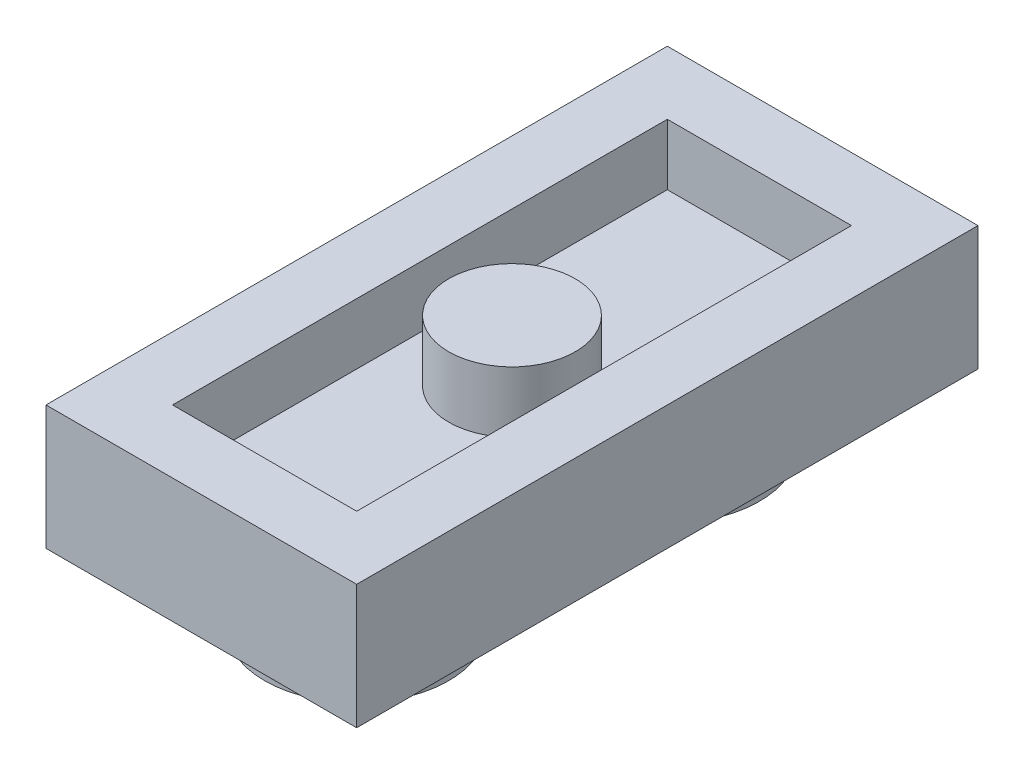
ISO-10303-21;
HEADER;
FILE_DESCRIPTION(('STEP AP214'),'2;1');
FILE_NAME('part.step','',(''),(''),'','','');
FILE_SCHEMA(('AUTOMOTIVE_DESIGN { 1 0 10303 214 1 1 1 1 }'));
ENDSEC;
DATA;
#1=APPLICATION_CONTEXT('core data for automotive mechanical design processes');
#2=APPLICATION_PROTOCOL_DEFINITION('international standard','automotive_design',2000,#1);
#3=PRODUCT_CONTEXT('',#1,'mechanical');
#4=PRODUCT('Part','Part','',(#3));
#5=PRODUCT_RELATED_PRODUCT_CATEGORY('part','',(#4));
#6=PRODUCT_DEFINITION_FORMATION('','',#4);
#7=PRODUCT_DEFINITION_CONTEXT('part definition',#1,'design');
#8=PRODUCT_DEFINITION('design','',#6,#7);
#9=PRODUCT_DEFINITION_SHAPE('','',#8);
#10=(LENGTH_UNIT() NAMED_UNIT(*) SI_UNIT(.MILLI.,.METRE.));
#11=(NAMED_UNIT(*) PLANE_ANGLE_UNIT() SI_UNIT($,.RADIAN.));
#12=(NAMED_UNIT(*) SI_UNIT($,.STERADIAN.) SOLID_ANGLE_UNIT());
#13=UNCERTAINTY_MEASURE_WITH_UNIT(LENGTH_MEASURE(1.E-05),#10,'distance_accuracy_value','');
#14=(GEOMETRIC_REPRESENTATION_CONTEXT(3) GLOBAL_UNCERTAINTY_ASSIGNED_CONTEXT((#13)) GLOBAL_UNIT_ASSIGNED_CONTEXT((#10,
#11,#12)) REPRESENTATION_CONTEXT('',''));
#15=CARTESIAN_POINT('',(0.,0.,0.));
#16=DIRECTION('',(0.,0.,1.));
#17=DIRECTION('',(1.,0.,0.));
#18=AXIS2_PLACEMENT_3D('',#15,#16,#17);
#19=CARTESIAN_POINT('',(0.,3.226,0.));
#20=DIRECTION('',(0.,1.,0.));
#21=DIRECTION('',(0.,0.,1.));
#22=AXIS2_PLACEMENT_3D('',#19,#20,#21);
#23=PLANE('',#22);
#24=CARTESIAN_POINT('',(0.,3.226,0.));
#25=DIRECTION('',(0.,1.,0.));
#26=DIRECTION('',(0.,0.,1.));
#27=AXIS2_PLACEMENT_3D('',#24,#25,#26);
#28=CIRCLE('',#27,1.6425);
#29=CARTESIAN_POINT('',(0.,3.226,1.6425));
#30=VERTEX_POINT('',#29);
#31=EDGE_CURVE('E19',#30,#30,#28,.F.);
#32=ORIENTED_EDGE('',*,*,#31,.F.);
#33=EDGE_LOOP('',(#32));
#34=FACE_BOUND('',#33,.T.);
#35=ADVANCED_FACE('F16',(#34),#23,.T.);
#36=CARTESIAN_POINT('',(0.,3.226,0.));
#37=DIRECTION('',(0.,1.,0.));
#38=DIRECTION('',(0.,0.,1.));
#39=AXIS2_PLACEMENT_3D('',#36,#37,#38);
#40=CYLINDRICAL_SURFACE('',#39,1.6425);
#41=ORIENTED_EDGE('',*,*,#31,.T.);
#42=EDGE_LOOP('',(#41));
#43=FACE_BOUND('',#42,.T.);
#44=CARTESIAN_POINT('',(0.,1.6425,0.));
#45=DIRECTION('',(0.,1.,0.));
#46=DIRECTION('',(0.,0.,1.));
#47=AXIS2_PLACEMENT_3D('',#44,#45,#46);
#48=CIRCLE('',#47,1.6425);
#49=CARTESIAN_POINT('',(0.,1.6425,1.6425));
#50=VERTEX_POINT('',#49);
#51=EDGE_CURVE('E94',#50,#50,#48,.F.);
#52=ORIENTED_EDGE('',*,*,#51,.F.);
#53=EDGE_LOOP('',(#52));
#54=FACE_BOUND('',#53,.T.);
#55=ADVANCED_FACE('F120',(#43,#54),#40,.T.);
#56=CARTESIAN_POINT('',(0.,1.6425,0.));
#57=DIRECTION('',(0.,1.,0.));
#58=DIRECTION('',(0.,0.,1.));
#59=AXIS2_PLACEMENT_3D('',#56,#57,#58);
#60=PLANE('',#59);
#61=ORIENTED_EDGE('',*,*,#51,.T.);
#62=EDGE_LOOP('',(#61));
#63=FACE_BOUND('',#62,.T.);
#64=DIRECTION('',(-1.,0.,0.));
#65=VECTOR('',#64,1.);
#66=CARTESIAN_POINT('',(4.0325,1.6425,-6.4225));
#67=LINE('',#66,#65);
#68=CARTESIAN_POINT('',(2.39,1.6425,-6.4225));
#69=VERTEX_POINT('',#68);
#70=CARTESIAN_POINT('',(-2.39,1.6425,-6.4225));
#71=VERTEX_POINT('',#70);
#72=EDGE_CURVE('E85',#69,#71,#67,.T.);
#73=ORIENTED_EDGE('',*,*,#72,.T.);
#74=DIRECTION('',(0.,0.,1.));
#75=VECTOR('',#74,1.);
#76=CARTESIAN_POINT('',(-2.39,1.6425,-8.065));
#77=LINE('',#76,#75);
#78=CARTESIAN_POINT('',(-2.39,1.6425,6.4225));
#79=VERTEX_POINT('',#78);
#80=EDGE_CURVE('E319',#71,#79,#77,.T.);
#81=ORIENTED_EDGE('',*,*,#80,.T.);
#82=DIRECTION('',(1.,0.,0.));
#83=VECTOR('',#82,1.);
#84=CARTESIAN_POINT('',(-4.0325,1.6425,6.4225));
#85=LINE('',#84,#83);
#86=CARTESIAN_POINT('',(2.39,1.6425,6.4225));
#87=VERTEX_POINT('',#86);
#88=EDGE_CURVE('E98',#79,#87,#85,.T.);
#89=ORIENTED_EDGE('',*,*,#88,.T.);
#90=DIRECTION('',(0.,0.,-1.));
#91=VECTOR('',#90,1.);
#92=CARTESIAN_POINT('',(2.39,1.6425,8.065));
#93=LINE('',#92,#91);
#94=EDGE_CURVE('E79',#87,#69,#93,.T.);
#95=ORIENTED_EDGE('',*,*,#94,.T.);
#96=EDGE_LOOP('',(#73,#81,#89,#95));
#97=FACE_BOUND('',#96,.T.);
#98=ADVANCED_FACE('F101',(#63,#97),#60,.T.);
#99=CARTESIAN_POINT('',(4.0325,0.,-6.4225));
#100=DIRECTION('',(0.,0.,-1.));
#101=DIRECTION('',(-1.,0.,0.));
#102=AXIS2_PLACEMENT_3D('',#99,#100,#101);
#103=PLANE('',#102);
#104=ORIENTED_EDGE('',*,*,#72,.F.);
#105=DIRECTION('',(0.,1.,0.));
#106=VECTOR('',#105,1.);
#107=CARTESIAN_POINT('',(2.39,0.,-6.4225));
#108=LINE('',#107,#106);
#109=CARTESIAN_POINT('',(2.39,3.226,-6.4225));
#110=VERTEX_POINT('',#109);
#111=EDGE_CURVE('E88',#69,#110,#108,.T.);
#112=ORIENTED_EDGE('',*,*,#111,.T.);
#113=DIRECTION('',(1.,0.,0.));
#114=VECTOR('',#113,1.);
#115=CARTESIAN_POINT('',(0.,3.226,-6.4225));
#116=LINE('',#115,#114);
#117=CARTESIAN_POINT('',(-2.39,3.226,-6.4225));
#118=VERTEX_POINT('',#117);
#119=EDGE_CURVE('E322',#118,#110,#116,.T.);
#120=ORIENTED_EDGE('',*,*,#119,.F.);
#121=DIRECTION('',(0.,1.,0.));
#122=VECTOR('',#121,1.);
#123=CARTESIAN_POINT('',(-2.39,0.,-6.4225));
#124=LINE('',#123,#122);
#125=EDGE_CURVE('E90',#118,#71,#124,.F.);
#126=ORIENTED_EDGE('',*,*,#125,.T.);
#127=EDGE_LOOP('',(#104,#112,#120,#126));
#128=FACE_BOUND('',#127,.T.);
#129=ADVANCED_FACE('F86',(#128),#103,.F.);
#130=CARTESIAN_POINT('',(2.39,0.,8.065));
#131=DIRECTION('',(1.,0.,0.));
#132=DIRECTION('',(0.,0.,-1.));
#133=AXIS2_PLACEMENT_3D('',#130,#131,#132);
#134=PLANE('',#133);
#135=ORIENTED_EDGE('',*,*,#94,.F.);
#136=DIRECTION('',(0.,1.,0.));
#137=VECTOR('',#136,1.);
#138=CARTESIAN_POINT('',(2.39,0.,6.4225));
#139=LINE('',#138,#137);
#140=CARTESIAN_POINT('',(2.39,3.226,6.4225));
#141=VERTEX_POINT('',#140);
#142=EDGE_CURVE('E318',#87,#141,#139,.T.);
#143=ORIENTED_EDGE('',*,*,#142,.T.);
#144=DIRECTION('',(0.,0.,1.));
#145=VECTOR('',#144,1.);
#146=CARTESIAN_POINT('',(2.39,3.226,0.));
#147=LINE('',#146,#145);
#148=EDGE_CURVE('E97',#110,#141,#147,.T.);
#149=ORIENTED_EDGE('',*,*,#148,.F.);
#150=ORIENTED_EDGE('',*,*,#111,.F.);
#151=EDGE_LOOP('',(#135,#143,#149,#150));
#152=FACE_BOUND('',#151,.T.);
#153=ADVANCED_FACE('F96',(#152),#134,.F.);
#154=CARTESIAN_POINT('',(-4.0325,0.,6.4225));
#155=DIRECTION('',(0.,0.,1.));
#156=DIRECTION('',(1.,0.,0.));
#157=AXIS2_PLACEMENT_3D('',#154,#155,#156);
#158=PLANE('',#157);
#159=ORIENTED_EDGE('',*,*,#88,.F.);
#160=DIRECTION('',(0.,1.,0.));
#161=VECTOR('',#160,1.);
#162=CARTESIAN_POINT('',(-2.39,0.,6.4225));
#163=LINE('',#162,#161);
#164=CARTESIAN_POINT('',(-2.39,3.226,6.4225));
#165=VERTEX_POINT('',#164);
#166=EDGE_CURVE('E316',#79,#165,#163,.T.);
#167=ORIENTED_EDGE('',*,*,#166,.T.);
#168=DIRECTION('',(1.,0.,0.));
#169=VECTOR('',#168,1.);
#170=CARTESIAN_POINT('',(0.,3.226,6.4225));
#171=LINE('',#170,#169);
#172=EDGE_CURVE('E328',#141,#165,#171,.F.);
#173=ORIENTED_EDGE('',*,*,#172,.F.);
#174=ORIENTED_EDGE('',*,*,#142,.F.);
#175=EDGE_LOOP('',(#159,#167,#173,#174));
#176=FACE_BOUND('',#175,.T.);
#177=ADVANCED_FACE('F175',(#176),#158,.F.);
#178=CARTESIAN_POINT('',(-2.39,0.,-8.065));
#179=DIRECTION('',(-1.,0.,0.));
#180=DIRECTION('',(0.,0.,1.));
#181=AXIS2_PLACEMENT_3D('',#178,#179,#180);
#182=PLANE('',#181);
#183=ORIENTED_EDGE('',*,*,#80,.F.);
#184=ORIENTED_EDGE('',*,*,#125,.F.);
#185=DIRECTION('',(0.,0.,1.));
#186=VECTOR('',#185,1.);
#187=CARTESIAN_POINT('',(-2.39,3.226,0.));
#188=LINE('',#187,#186);
#189=EDGE_CURVE('E321',#165,#118,#188,.F.);
#190=ORIENTED_EDGE('',*,*,#189,.F.);
#191=ORIENTED_EDGE('',*,*,#166,.F.);
#192=EDGE_LOOP('',(#183,#184,#190,#191));
#193=FACE_BOUND('',#192,.T.);
#194=ADVANCED_FACE('F171',(#193),#182,.F.);
#195=CARTESIAN_POINT('',(0.,3.226,0.));
#196=DIRECTION('',(0.,1.,0.));
#197=DIRECTION('',(0.,0.,1.));
#198=AXIS2_PLACEMENT_3D('',#195,#196,#197);
#199=PLANE('',#198);
#200=ORIENTED_EDGE('',*,*,#172,.T.);
#201=ORIENTED_EDGE('',*,*,#189,.T.);
#202=ORIENTED_EDGE('',*,*,#119,.T.);
#203=ORIENTED_EDGE('',*,*,#148,.T.);
#204=EDGE_LOOP('',(#200,#201,#202,#203));
#205=FACE_BOUND('',#204,.T.);
#206=DIRECTION('',(-1.,0.,0.));
#207=VECTOR('',#206,1.);
#208=CARTESIAN_POINT('',(4.0325,3.226,-8.065));
#209=LINE('',#208,#207);
#210=CARTESIAN_POINT('',(-4.0325,3.226,-8.065));
#211=VERTEX_POINT('',#210);
#212=CARTESIAN_POINT('',(4.0325,3.226,-8.065));
#213=VERTEX_POINT('',#212);
#214=EDGE_CURVE('E338',#211,#213,#209,.F.);
#215=ORIENTED_EDGE('',*,*,#214,.F.);
#216=DIRECTION('',(0.,0.,1.));
#217=VECTOR('',#216,1.);
#218=CARTESIAN_POINT('',(-4.0325,3.226,-8.065));
#219=LINE('',#218,#217);
#220=CARTESIAN_POINT('',(-4.0325,3.226,8.065));
#221=VERTEX_POINT('',#220);
#222=EDGE_CURVE('E330',#221,#211,#219,.F.);
#223=ORIENTED_EDGE('',*,*,#222,.F.);
#224=DIRECTION('',(1.,0.,0.));
#225=VECTOR('',#224,1.);
#226=CARTESIAN_POINT('',(-4.0325,3.226,8.065));
#227=LINE('',#226,#225);
#228=CARTESIAN_POINT('',(4.0325,3.226,8.065));
#229=VERTEX_POINT('',#228);
#230=EDGE_CURVE('E354',#229,#221,#227,.F.);
#231=ORIENTED_EDGE('',*,*,#230,.F.);
#232=DIRECTION('',(0.,0.,-1.));
#233=VECTOR('',#232,1.);
#234=CARTESIAN_POINT('',(4.0325,3.226,8.065));
#235=LINE('',#234,#233);
#236=EDGE_CURVE('E341',#213,#229,#235,.F.);
#237=ORIENTED_EDGE('',*,*,#236,.F.);
#238=EDGE_LOOP('',(#215,#223,#231,#237));
#239=FACE_BOUND('',#238,.T.);
#240=ADVANCED_FACE('F167',(#205,#239),#199,.T.);
#241=CARTESIAN_POINT('',(0.,-1.78,0.));
#242=DIRECTION('',(0.,1.,0.));
#243=DIRECTION('',(0.,0.,1.));
#244=AXIS2_PLACEMENT_3D('',#241,#242,#243);
#245=PLANE('',#244);
#246=CARTESIAN_POINT('',(0.,-1.78,-4.0325));
#247=DIRECTION('',(0.,1.,0.));
#248=DIRECTION('',(0.,0.,1.));
#249=AXIS2_PLACEMENT_3D('',#246,#247,#248);
#250=CIRCLE('',#249,2.39);
#251=CARTESIAN_POINT('',(0.,-1.78,-1.6425));
#252=VERTEX_POINT('',#251);
#253=EDGE_CURVE('E112',#252,#252,#250,.T.);
#254=ORIENTED_EDGE('',*,*,#253,.F.);
#255=EDGE_LOOP('',(#254));
#256=FACE_BOUND('',#255,.T.);
#257=ADVANCED_FACE('F163',(#256),#245,.F.);
#258=CARTESIAN_POINT('',(0.,-1.78,0.));
#259=DIRECTION('',(0.,1.,0.));
#260=DIRECTION('',(0.,0.,1.));
#261=AXIS2_PLACEMENT_3D('',#258,#259,#260);
#262=PLANE('',#261);
#263=CARTESIAN_POINT('',(0.,-1.78,4.0325));
#264=DIRECTION('',(0.,1.,0.));
#265=DIRECTION('',(0.,0.,1.));
#266=AXIS2_PLACEMENT_3D('',#263,#264,#265);
#267=CIRCLE('',#266,2.39);
#268=CARTESIAN_POINT('',(0.,-1.78,6.4225));
#269=VERTEX_POINT('',#268);
#270=EDGE_CURVE('E108',#269,#269,#267,.T.);
#271=ORIENTED_EDGE('',*,*,#270,.F.);
#272=EDGE_LOOP('',(#271));
#273=FACE_BOUND('',#272,.T.);
#274=ADVANCED_FACE('F159',(#273),#262,.F.);
#275=CARTESIAN_POINT('',(-4.0325,0.,-8.065));
#276=DIRECTION('',(-1.,0.,0.));
#277=DIRECTION('',(0.,0.,1.));
#278=AXIS2_PLACEMENT_3D('',#275,#276,#277);
#279=PLANE('',#278);
#280=DIRECTION('',(0.,1.,0.));
#281=VECTOR('',#280,1.);
#282=CARTESIAN_POINT('',(-4.0325,0.,-8.065));
#283=LINE('',#282,#281);
#284=CARTESIAN_POINT('',(-4.0325,0.,-8.065));
#285=VERTEX_POINT('',#284);
#286=EDGE_CURVE('E343',#285,#211,#283,.T.);
#287=ORIENTED_EDGE('',*,*,#286,.F.);
#288=DIRECTION('',(0.,0.,1.));
#289=VECTOR('',#288,1.);
#290=CARTESIAN_POINT('',(-4.0325,0.,0.));
#291=LINE('',#290,#289);
#292=CARTESIAN_POINT('',(-4.0325,0.,8.065));
#293=VERTEX_POINT('',#292);
#294=EDGE_CURVE('E111',#285,#293,#291,.T.);
#295=ORIENTED_EDGE('',*,*,#294,.T.);
#296=DIRECTION('',(0.,1.,0.));
#297=VECTOR('',#296,1.);
#298=CARTESIAN_POINT('',(-4.0325,0.,8.065));
#299=LINE('',#298,#297);
#300=EDGE_CURVE('E352',#221,#293,#299,.F.);
#301=ORIENTED_EDGE('',*,*,#300,.F.);
#302=ORIENTED_EDGE('',*,*,#222,.T.);
#303=EDGE_LOOP('',(#287,#295,#301,#302));
#304=FACE_BOUND('',#303,.T.);
#305=ADVANCED_FACE('F155',(#304),#279,.T.);
#306=CARTESIAN_POINT('',(-4.0325,0.,8.065));
#307=DIRECTION('',(0.,0.,1.));
#308=DIRECTION('',(1.,0.,0.));
#309=AXIS2_PLACEMENT_3D('',#306,#307,#308);
#310=PLANE('',#309);
#311=ORIENTED_EDGE('',*,*,#300,.T.);
#312=DIRECTION('',(1.,0.,0.));
#313=VECTOR('',#312,1.);
#314=CARTESIAN_POINT('',(0.,0.,8.065));
#315=LINE('',#314,#313);
#316=CARTESIAN_POINT('',(4.0325,0.,8.065));
#317=VERTEX_POINT('',#316);
#318=EDGE_CURVE('E362',#293,#317,#315,.T.);
#319=ORIENTED_EDGE('',*,*,#318,.T.);
#320=DIRECTION('',(0.,1.,0.));
#321=VECTOR('',#320,1.);
#322=CARTESIAN_POINT('',(4.0325,0.,8.065));
#323=LINE('',#322,#321);
#324=EDGE_CURVE('E346',#229,#317,#323,.F.);
#325=ORIENTED_EDGE('',*,*,#324,.F.);
#326=ORIENTED_EDGE('',*,*,#230,.T.);
#327=EDGE_LOOP('',(#311,#319,#325,#326));
#328=FACE_BOUND('',#327,.T.);
#329=ADVANCED_FACE('F151',(#328),#310,.T.);
#330=CARTESIAN_POINT('',(4.0325,0.,8.065));
#331=DIRECTION('',(1.,0.,0.));
#332=DIRECTION('',(0.,0.,-1.));
#333=AXIS2_PLACEMENT_3D('',#330,#331,#332);
#334=PLANE('',#333);
#335=ORIENTED_EDGE('',*,*,#324,.T.);
#336=DIRECTION('',(0.,0.,1.));
#337=VECTOR('',#336,1.);
#338=CARTESIAN_POINT('',(4.0325,0.,0.));
#339=LINE('',#338,#337);
#340=CARTESIAN_POINT('',(4.0325,0.,-8.065));
#341=VERTEX_POINT('',#340);
#342=EDGE_CURVE('E360',#317,#341,#339,.F.);
#343=ORIENTED_EDGE('',*,*,#342,.T.);
#344=DIRECTION('',(0.,1.,0.));
#345=VECTOR('',#344,1.);
#346=CARTESIAN_POINT('',(4.0325,0.,-8.065));
#347=LINE('',#346,#345);
#348=EDGE_CURVE('E34',#213,#341,#347,.F.);
#349=ORIENTED_EDGE('',*,*,#348,.F.);
#350=ORIENTED_EDGE('',*,*,#236,.T.);
#351=EDGE_LOOP('',(#335,#343,#349,#350));
#352=FACE_BOUND('',#351,.T.);
#353=ADVANCED_FACE('F148',(#352),#334,.T.);
#354=CARTESIAN_POINT('',(4.0325,0.,-8.065));
#355=DIRECTION('',(0.,0.,-1.));
#356=DIRECTION('',(-1.,0.,0.));
#357=AXIS2_PLACEMENT_3D('',#354,#355,#356);
#358=PLANE('',#357);
#359=ORIENTED_EDGE('',*,*,#348,.T.);
#360=DIRECTION('',(1.,0.,0.));
#361=VECTOR('',#360,1.);
#362=CARTESIAN_POINT('',(0.,0.,-8.065));
#363=LINE('',#362,#361);
#364=EDGE_CURVE('E107',#341,#285,#363,.F.);
#365=ORIENTED_EDGE('',*,*,#364,.T.);
#366=ORIENTED_EDGE('',*,*,#286,.T.);
#367=ORIENTED_EDGE('',*,*,#214,.T.);
#368=EDGE_LOOP('',(#359,#365,#366,#367));
#369=FACE_BOUND('',#368,.T.);
#370=ADVANCED_FACE('F144',(#369),#358,.T.);
#371=CARTESIAN_POINT('',(0.,0.,-4.0325));
#372=DIRECTION('',(0.,1.,0.));
#373=DIRECTION('',(0.,0.,1.));
#374=AXIS2_PLACEMENT_3D('',#371,#372,#373);
#375=CYLINDRICAL_SURFACE('',#374,2.39);
#376=ORIENTED_EDGE('',*,*,#253,.T.);
#377=EDGE_LOOP('',(#376));
#378=FACE_BOUND('',#377,.T.);
#379=CARTESIAN_POINT('',(0.,0.,-4.0325));
#380=DIRECTION('',(0.,1.,0.));
#381=DIRECTION('',(0.,0.,1.));
#382=AXIS2_PLACEMENT_3D('',#379,#380,#381);
#383=CIRCLE('',#382,2.39);
#384=CARTESIAN_POINT('',(0.,0.,-1.6425));
#385=VERTEX_POINT('',#384);
#386=EDGE_CURVE('E25',#385,#385,#383,.F.);
#387=ORIENTED_EDGE('',*,*,#386,.T.);
#388=EDGE_LOOP('',(#387));
#389=FACE_BOUND('',#388,.T.);
#390=ADVANCED_FACE('F136',(#378,#389),#375,.T.);
#391=CARTESIAN_POINT('',(0.,0.,4.0325));
#392=DIRECTION('',(0.,1.,0.));
#393=DIRECTION('',(0.,0.,1.));
#394=AXIS2_PLACEMENT_3D('',#391,#392,#393);
#395=CYLINDRICAL_SURFACE('',#394,2.39);
#396=ORIENTED_EDGE('',*,*,#270,.T.);
#397=EDGE_LOOP('',(#396));
#398=FACE_BOUND('',#397,.T.);
#399=CARTESIAN_POINT('',(0.,0.,4.0325));
#400=DIRECTION('',(0.,1.,0.));
#401=DIRECTION('',(0.,0.,1.));
#402=AXIS2_PLACEMENT_3D('',#399,#400,#401);
#403=CIRCLE('',#402,2.39);
#404=CARTESIAN_POINT('',(0.,0.,6.4225));
#405=VERTEX_POINT('',#404);
#406=EDGE_CURVE('E10',#405,#405,#403,.F.);
#407=ORIENTED_EDGE('',*,*,#406,.T.);
#408=EDGE_LOOP('',(#407));
#409=FACE_BOUND('',#408,.T.);
#410=ADVANCED_FACE('F130',(#398,#409),#395,.T.);
#411=CARTESIAN_POINT('',(0.,0.,0.));
#412=DIRECTION('',(0.,1.,0.));
#413=DIRECTION('',(0.,0.,1.));
#414=AXIS2_PLACEMENT_3D('',#411,#412,#413);
#415=PLANE('',#414);
#416=ORIENTED_EDGE('',*,*,#406,.F.);
#417=EDGE_LOOP('',(#416));
#418=FACE_BOUND('',#417,.T.);
#419=ORIENTED_EDGE('',*,*,#386,.F.);
#420=EDGE_LOOP('',(#419));
#421=FACE_BOUND('',#420,.T.);
#422=ORIENTED_EDGE('',*,*,#342,.F.);
#423=ORIENTED_EDGE('',*,*,#318,.F.);
#424=ORIENTED_EDGE('',*,*,#294,.F.);
#425=ORIENTED_EDGE('',*,*,#364,.F.);
#426=EDGE_LOOP('',(#422,#423,#424,#425));
#427=FACE_BOUND('',#426,.T.);
#428=ADVANCED_FACE('F128',(#418,#421,#427),#415,.F.);
#429=CLOSED_SHELL('',(#35,#55,#98,#129,#153,#177,#194,#240,#257,#274,#305,#329,#353,#370,#390,
#410,#428));
#430=MANIFOLD_SOLID_BREP('B1',#429);
#431=ADVANCED_BREP_SHAPE_REPRESENTATION('',(#18,#430),#14);
#432=SHAPE_DEFINITION_REPRESENTATION(#9,#431);
ENDSEC;
END-ISO-10303-21;
